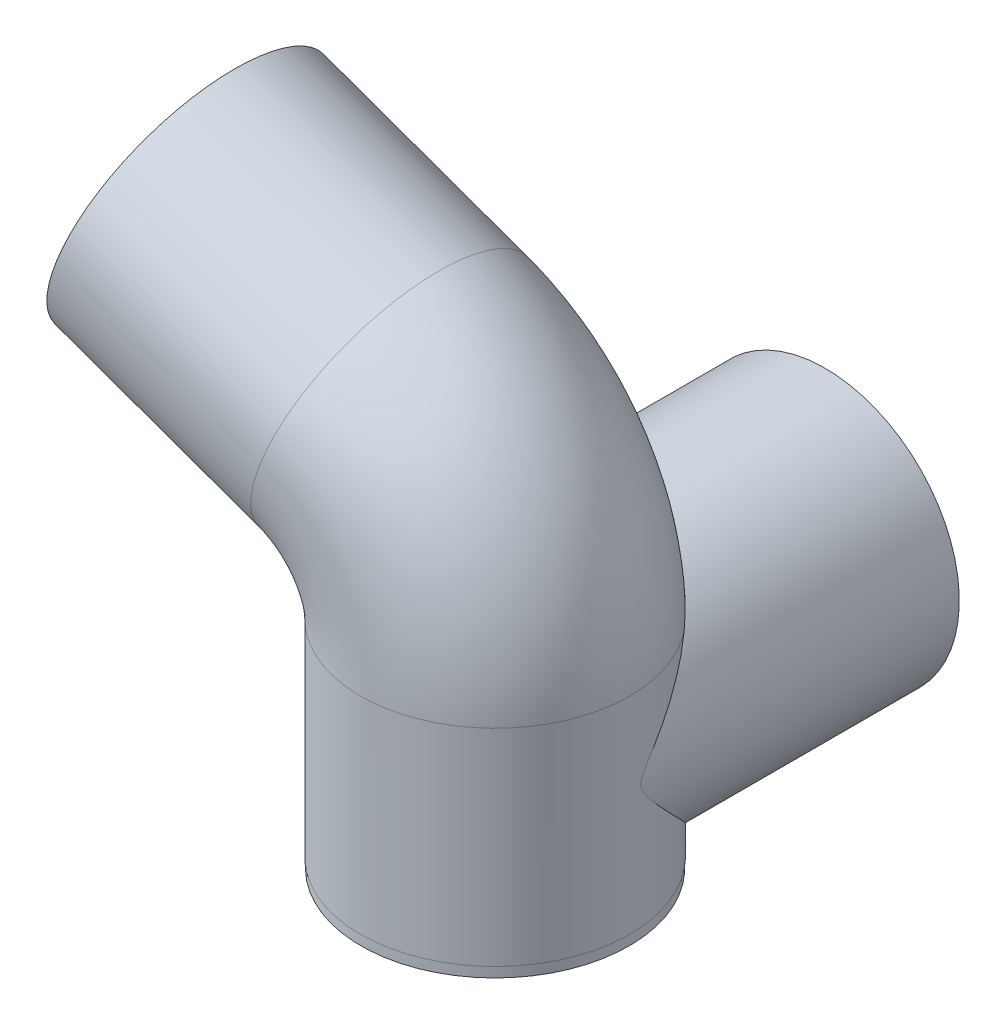
ISO-10303-21;
HEADER;
FILE_DESCRIPTION(('STEP AP214'),'2;1');
FILE_NAME('part.step','',(''),(''),'','','');
FILE_SCHEMA(('AUTOMOTIVE_DESIGN { 1 0 10303 214 1 1 1 1 }'));
ENDSEC;
DATA;
#1=APPLICATION_CONTEXT('core data for automotive mechanical design processes');
#2=APPLICATION_PROTOCOL_DEFINITION('international standard','automotive_design',2000,#1);
#3=PRODUCT_CONTEXT('',#1,'mechanical');
#4=PRODUCT('Part','Part','',(#3));
#5=PRODUCT_RELATED_PRODUCT_CATEGORY('part','',(#4));
#6=PRODUCT_DEFINITION_FORMATION('','',#4);
#7=PRODUCT_DEFINITION_CONTEXT('part definition',#1,'design');
#8=PRODUCT_DEFINITION('design','',#6,#7);
#9=PRODUCT_DEFINITION_SHAPE('','',#8);
#10=(LENGTH_UNIT() NAMED_UNIT(*) SI_UNIT(.MILLI.,.METRE.));
#11=(NAMED_UNIT(*) PLANE_ANGLE_UNIT() SI_UNIT($,.RADIAN.));
#12=(NAMED_UNIT(*) SI_UNIT($,.STERADIAN.) SOLID_ANGLE_UNIT());
#13=UNCERTAINTY_MEASURE_WITH_UNIT(LENGTH_MEASURE(1.E-05),#10,'distance_accuracy_value','');
#14=(GEOMETRIC_REPRESENTATION_CONTEXT(3) GLOBAL_UNCERTAINTY_ASSIGNED_CONTEXT((#13)) GLOBAL_UNIT_ASSIGNED_CONTEXT((#10,
#11,#12)) REPRESENTATION_CONTEXT('',''));
#15=CARTESIAN_POINT('',(0.,0.,0.));
#16=DIRECTION('',(0.,0.,1.));
#17=DIRECTION('',(1.,0.,0.));
#18=AXIS2_PLACEMENT_3D('',#15,#16,#17);
#19=CARTESIAN_POINT('',(0.,0.,0.));
#20=DIRECTION('',(0.,1.,0.));
#21=DIRECTION('',(0.,0.,1.));
#22=AXIS2_PLACEMENT_3D('',#19,#20,#21);
#23=PLANE('',#22);
#24=CARTESIAN_POINT('',(0.,0.,0.));
#25=DIRECTION('',(0.,1.,0.));
#26=DIRECTION('',(0.,0.,1.));
#27=AXIS2_PLACEMENT_3D('',#24,#25,#26);
#28=CIRCLE('',#27,13.);
#29=CARTESIAN_POINT('',(0.,0.,-13.));
#30=VERTEX_POINT('',#29);
#31=EDGE_CURVE('E59',#30,#30,#28,.T.);
#32=ORIENTED_EDGE('',*,*,#31,.F.);
#33=EDGE_LOOP('',(#32));
#34=FACE_BOUND('',#33,.T.);
#35=CARTESIAN_POINT('',(0.,0.,0.));
#36=DIRECTION('',(0.,1.,0.));
#37=DIRECTION('',(0.,0.,1.));
#38=AXIS2_PLACEMENT_3D('',#35,#36,#37);
#39=CIRCLE('',#38,11.05);
#40=CARTESIAN_POINT('',(0.,0.,11.05));
#41=VERTEX_POINT('',#40);
#42=EDGE_CURVE('E156',#41,#41,#39,.T.);
#43=ORIENTED_EDGE('',*,*,#42,.T.);
#44=EDGE_LOOP('',(#43));
#45=FACE_BOUND('',#44,.T.);
#46=ADVANCED_FACE('F55',(#34,#45),#23,.F.);
#47=CARTESIAN_POINT('',(0.,1.,0.));
#48=DIRECTION('',(0.,-1.,0.));
#49=DIRECTION('',(0.,0.,-1.));
#50=AXIS2_PLACEMENT_3D('',#47,#48,#49);
#51=CYLINDRICAL_SURFACE('',#50,13.);
#52=CARTESIAN_POINT('',(0.,1.,0.));
#53=DIRECTION('',(0.,1.,0.));
#54=DIRECTION('',(0.,0.,1.));
#55=AXIS2_PLACEMENT_3D('',#52,#53,#54);
#56=CIRCLE('',#55,13.);
#57=CARTESIAN_POINT('',(-5.00000000000006,1.,-12.));
#58=VERTEX_POINT('',#57);
#59=CARTESIAN_POINT('',(5.,1.,-12.));
#60=VERTEX_POINT('',#59);
#61=EDGE_CURVE('E12',#58,#60,#56,.T.);
#62=ORIENTED_EDGE('',*,*,#61,.F.);
#63=CARTESIAN_POINT('',(0.,13.,0.));
#64=DIRECTION('',(0.,0.707106781186548,-0.707106781186547));
#65=DIRECTION('',(0.,-0.707106781186548,-0.707106781186547));
#66=AXIS2_PLACEMENT_3D('',#63,#64,#65);
#67=ELLIPSE('',#66,18.3847763108502,13.);
#68=EDGE_CURVE('E131',#30,#58,#67,.T.);
#69=ORIENTED_EDGE('',*,*,#68,.F.);
#70=ORIENTED_EDGE('',*,*,#31,.T.);
#71=EDGE_CURVE('E124',#60,#30,#67,.T.);
#72=ORIENTED_EDGE('',*,*,#71,.F.);
#73=EDGE_LOOP('',(#62,#69,#70,#72));
#74=FACE_BOUND('',#73,.T.);
#75=ADVANCED_FACE('F57',(#74),#51,.T.);
#76=CARTESIAN_POINT('',(0.,1.,0.));
#77=DIRECTION('',(0.,-1.,0.));
#78=DIRECTION('',(0.,0.,-1.));
#79=AXIS2_PLACEMENT_3D('',#76,#77,#78);
#80=CYLINDRICAL_SURFACE('',#79,11.05);
#81=CARTESIAN_POINT('',(0.,13.,0.));
#82=DIRECTION('',(0.,-0.707106781186547,-0.707106781186547));
#83=DIRECTION('',(0.,0.707106781186547,-0.707106781186547));
#84=AXIS2_PLACEMENT_3D('',#81,#82,#83);
#85=ELLIPSE('',#84,15.6270598642227,11.05);
#86=CARTESIAN_POINT('',(7.62249959002947,21.,-8.00000000000004));
#87=VERTEX_POINT('',#86);
#88=CARTESIAN_POINT('',(11.0500000000001,13.,0.));
#89=VERTEX_POINT('',#88);
#90=EDGE_CURVE('E71',#87,#89,#85,.T.);
#91=ORIENTED_EDGE('',*,*,#90,.T.);
#92=CARTESIAN_POINT('',(0.,13.,0.));
#93=DIRECTION('',(0.,0.707106781186547,-0.707106781186547));
#94=DIRECTION('',(0.,-0.707106781186547,-0.707106781186547));
#95=AXIS2_PLACEMENT_3D('',#92,#93,#94);
#96=ELLIPSE('',#95,15.6270598642227,11.05);
#97=CARTESIAN_POINT('',(-11.05,13.,0.));
#98=VERTEX_POINT('',#97);
#99=EDGE_CURVE('E117',#89,#98,#96,.T.);
#100=ORIENTED_EDGE('',*,*,#99,.T.);
#101=CARTESIAN_POINT('',(-7.62249959002946,21.,-8.00000000000005));
#102=VERTEX_POINT('',#101);
#103=EDGE_CURVE('E106',#98,#102,#85,.T.);
#104=ORIENTED_EDGE('',*,*,#103,.T.);
#105=CARTESIAN_POINT('',(0.,21.,0.));
#106=DIRECTION('',(0.,-1.,0.));
#107=DIRECTION('',(1.,0.,0.));
#108=AXIS2_PLACEMENT_3D('',#105,#106,#107);
#109=CIRCLE('',#108,11.05);
#110=EDGE_CURVE('E116',#87,#102,#109,.T.);
#111=ORIENTED_EDGE('',*,*,#110,.F.);
#112=EDGE_LOOP('',(#91,#100,#104,#111));
#113=FACE_BOUND('',#112,.T.);
#114=ORIENTED_EDGE('',*,*,#42,.F.);
#115=EDGE_LOOP('',(#114));
#116=FACE_BOUND('',#115,.T.);
#117=ADVANCED_FACE('F114',(#113,#116),#80,.F.);
#118=CARTESIAN_POINT('',(0.,1.,0.));
#119=DIRECTION('',(0.,-1.,0.));
#120=DIRECTION('',(1.,0.,0.));
#121=AXIS2_PLACEMENT_3D('',#118,#119,#120);
#122=PLANE('',#121);
#123=DIRECTION('',(0.,0.,-1.));
#124=VECTOR('',#123,1.);
#125=CARTESIAN_POINT('',(-4.9999999999998,0.999999999999997,13.052));
#126=LINE('',#125,#124);
#127=CARTESIAN_POINT('',(-4.99999999999998,1.,-12.0541486634271));
#128=VERTEX_POINT('',#127);
#129=EDGE_CURVE('E134',#128,#58,#126,.F.);
#130=ORIENTED_EDGE('',*,*,#129,.T.);
#131=ORIENTED_EDGE('',*,*,#61,.T.);
#132=DIRECTION('',(0.,0.,-1.));
#133=VECTOR('',#132,1.);
#134=CARTESIAN_POINT('',(5.00000000000018,0.999999999999991,13.052));
#135=LINE('',#134,#133);
#136=CARTESIAN_POINT('',(5.00000000000001,0.999999999999994,-12.054148663427));
#137=VERTEX_POINT('',#136);
#138=EDGE_CURVE('E259',#60,#137,#135,.T.);
#139=ORIENTED_EDGE('',*,*,#138,.T.);
#140=CARTESIAN_POINT('',(0.,1.,0.));
#141=DIRECTION('',(0.,-1.,0.));
#142=DIRECTION('',(1.,0.,0.));
#143=AXIS2_PLACEMENT_3D('',#140,#141,#142);
#144=CIRCLE('',#143,13.05);
#145=EDGE_CURVE('E140',#137,#128,#144,.T.);
#146=ORIENTED_EDGE('',*,*,#145,.T.);
#147=EDGE_LOOP('',(#130,#131,#139,#146));
#148=FACE_BOUND('',#147,.T.);
#149=ADVANCED_FACE('F176',(#148),#122,.T.);
#150=CARTESIAN_POINT('',(-29.6774273443593,42.2267078594645,0.));
#151=DIRECTION('',(0.940880768954225,-0.338737920245293,0.));
#152=DIRECTION('',(0.338737920245293,0.940880768954225,0.));
#153=AXIS2_PLACEMENT_3D('',#150,#151,#152);
#154=PLANE('',#153);
#155=CARTESIAN_POINT('',(-29.6774273443593,42.2267078594645,0.));
#156=DIRECTION('',(0.940880768954225,-0.338737920245293,0.));
#157=DIRECTION('',(0.338737920245293,0.940880768954225,0.));
#158=AXIS2_PLACEMENT_3D('',#155,#156,#157);
#159=CIRCLE('',#158,11.05);
#160=CARTESIAN_POINT('',(-25.9343733256489,52.6234403564087,0.));
#161=VERTEX_POINT('',#160);
#162=EDGE_CURVE('E129',#161,#161,#159,.T.);
#163=ORIENTED_EDGE('',*,*,#162,.T.);
#164=EDGE_LOOP('',(#163));
#165=FACE_BOUND('',#164,.T.);
#166=CARTESIAN_POINT('',(-29.6774273443593,42.2267078594645,0.));
#167=DIRECTION('',(0.940880768954225,-0.338737920245293,0.));
#168=DIRECTION('',(0.338737920245293,0.940880768954225,0.));
#169=AXIS2_PLACEMENT_3D('',#166,#167,#168);
#170=CIRCLE('',#169,13.05);
#171=CARTESIAN_POINT('',(-25.2568974851583,54.5052018943171,0.));
#172=VERTEX_POINT('',#171);
#173=EDGE_CURVE('E149',#172,#172,#170,.T.);
#174=ORIENTED_EDGE('',*,*,#173,.F.);
#175=EDGE_LOOP('',(#174));
#176=FACE_BOUND('',#175,.T.);
#177=ADVANCED_FACE('F188',(#165,#176),#154,.F.);
#178=CARTESIAN_POINT('',(0.,1.,0.));
#179=DIRECTION('',(0.,1.,0.));
#180=DIRECTION('',(0.,0.,1.));
#181=AXIS2_PLACEMENT_3D('',#178,#179,#180);
#182=CYLINDRICAL_SURFACE('',#181,13.05);
#183=ORIENTED_EDGE('',*,*,#145,.F.);
#184=CARTESIAN_POINT('',(10.2469507659596,21.,-8.08099622571369));
#185=CARTESIAN_POINT('',(10.3808410462382,20.8284917543246,-7.91121067679215));
#186=CARTESIAN_POINT('',(10.5094661617356,20.6548757455195,-7.73944037509073));
#187=CARTESIAN_POINT('',(10.7563809429985,20.3038590573796,-7.39243812402004));
#188=CARTESIAN_POINT('',(10.8746722408285,20.1264589812052,-7.21720672665592));
#189=CARTESIAN_POINT('',(11.1011133739727,19.7683186934407,-6.86380341560327));
#190=CARTESIAN_POINT('',(11.2092670542295,19.5875797795771,-6.6856326471428));
#191=CARTESIAN_POINT('',(11.4156826720345,19.2230271492222,-6.32673262151035));
#192=CARTESIAN_POINT('',(11.5139442164868,19.0392133108771,-6.14600326298981));
#193=CARTESIAN_POINT('',(11.7933954977298,18.485120511006,-5.60214581959144));
#194=CARTESIAN_POINT('',(11.9602212374878,18.1106463285789,-5.23582227934634));
#195=CARTESIAN_POINT('',(12.2566354160424,17.352115092751,-4.49833684960306));
#196=CARTESIAN_POINT('',(12.3862324168029,16.9680602648504,-4.1271760931404));
#197=CARTESIAN_POINT('',(12.5623553430608,16.3529451040081,-3.54122118979744));
#198=CARTESIAN_POINT('',(12.6209045680761,16.1254114317597,-3.32625979739433));
#199=CARTESIAN_POINT('',(12.7259619832473,15.6656468472234,-2.89839730757131));
#200=CARTESIAN_POINT('',(12.7724714758277,15.4334164459471,-2.68549598969885));
#201=CARTESIAN_POINT('',(12.8391301604418,15.0446571069226,-2.34058353361841));
#202=CARTESIAN_POINT('',(12.8627816636026,14.8904435329805,-2.20662626494794));
#203=CARTESIAN_POINT('',(12.9050331601704,14.5765031408036,-1.94424342329985));
#204=CARTESIAN_POINT('',(12.9236326490663,14.4167757737369,-1.81581840386773));
#205=CARTESIAN_POINT('',(12.9491792950359,14.1526653618386,-1.62073610916529));
#206=CARTESIAN_POINT('',(12.9578162870282,14.051592184922,-1.54985829636127));
#207=CARTESIAN_POINT('',(12.9730320212486,13.8434291876135,-1.41680751451272));
#208=CARTESIAN_POINT('',(12.9796110245195,13.736340132332,-1.35463344200736));
#209=CARTESIAN_POINT('',(12.9883696046164,13.5542758365987,-1.26726080635209));
#210=CARTESIAN_POINT('',(12.9912779029396,13.4819111290161,-1.23686130269502));
#211=CARTESIAN_POINT('',(12.9959299885436,13.3335802475062,-1.18698398858763));
#212=CARTESIAN_POINT('',(12.9976782423569,13.2576291075595,-1.16746433436077));
#213=CARTESIAN_POINT('',(12.9998357442867,13.101907499195,-1.14322119940031));
#214=CARTESIAN_POINT('',(13.000222583798,13.022094841885,-1.13874539046551));
#215=CARTESIAN_POINT('',(12.9995249758655,12.8633325907508,-1.14667072324129));
#216=CARTESIAN_POINT('',(12.9984392905787,12.7843837793599,-1.15908606412156));
#217=CARTESIAN_POINT('',(12.9945253148589,12.6104745231601,-1.2022264894999));
#218=CARTESIAN_POINT('',(12.9913242484745,12.5165445995239,-1.23680325917943));
#219=CARTESIAN_POINT('',(12.9832656874965,12.3342476517767,-1.31871580503453));
#220=CARTESIAN_POINT('',(12.9783981155876,12.2459184393391,-1.36612882791994));
#221=CARTESIAN_POINT('',(12.9671054278656,12.0715685929964,-1.46951009975087));
#222=CARTESIAN_POINT('',(12.96064374859,11.9856643223701,-1.52566572928785));
#223=CARTESIAN_POINT('',(12.9463490073172,11.8171269200464,-1.64257138028421));
#224=CARTESIAN_POINT('',(12.9385148978194,11.734496346478,-1.70332489078995));
#225=CARTESIAN_POINT('',(12.9130112432641,11.489631672811,-1.89006765275296));
#226=CARTESIAN_POINT('',(12.8933687886485,11.3308411721565,-2.02026533621046));
#227=CARTESIAN_POINT('',(12.8489230154375,11.0175274002601,-2.28605725641017));
#228=CARTESIAN_POINT('',(12.8240978178178,10.8630254711406,-2.42167233422897));
#229=CARTESIAN_POINT('',(12.7694080525553,10.5574049696717,-2.69520731115324));
#230=CARTESIAN_POINT('',(12.7395510318893,10.406281708735,-2.83312348389441));
#231=CARTESIAN_POINT('',(12.6559032832171,10.0188718397944,-3.19080756683837));
#232=CARTESIAN_POINT('',(12.5982994718524,9.78423476792043,-3.41147553451599));
#233=CARTESIAN_POINT('',(12.4702690353903,9.31889108673759,-3.85329376828967));
#234=CARTESIAN_POINT('',(12.3998403751194,9.08818510761678,-4.07444410542174));
#235=CARTESIAN_POINT('',(12.2458822911106,8.63000625267417,-4.51615275042353));
#236=CARTESIAN_POINT('',(12.1623367176265,8.40253774448792,-4.73670998298098));
#237=CARTESIAN_POINT('',(11.9819937981104,7.95115187512437,-5.17597401026042));
#238=CARTESIAN_POINT('',(11.8851971905002,7.72723431684361,-5.39468090737286));
#239=CARTESIAN_POINT('',(11.5749956116551,7.06210312414209,-6.04589605550298));
#240=CARTESIAN_POINT('',(11.3413966441153,6.62636466762003,-6.47461058870069));
#241=CARTESIAN_POINT('',(10.8180596589172,5.7736906031614,-7.31554881329494));
#242=CARTESIAN_POINT('',(10.5283711072808,5.35673882354873,-7.72778665200868));
#243=CARTESIAN_POINT('',(10.0080048463175,4.69667009467079,-8.38131969639317));
#244=CARTESIAN_POINT('',(9.79511015214829,4.44627912672783,-8.6294639878954));
#245=CARTESIAN_POINT('',(9.34521897009939,3.95690863050472,-9.11476890940701));
#246=CARTESIAN_POINT('',(9.10822216250644,3.71792925366054,-9.35192939365603));
#247=CARTESIAN_POINT('',(8.36161901468556,3.02282819346423,-10.0420811889809));
#248=CARTESIAN_POINT('',(7.81458720312425,2.58619023107309,-10.4760751758488));
#249=CARTESIAN_POINT('',(6.88014261209599,1.96241614889428,-11.0964056281183));
#250=CARTESIAN_POINT('',(6.52672500782917,1.74933549740671,-11.308384532796));
#251=CARTESIAN_POINT('',(5.78737907084385,1.35169416009695,-11.7040652013761));
#252=CARTESIAN_POINT('',(5.40133501385108,1.16724218997281,-11.8876591654066));
#253=CARTESIAN_POINT('',(5.00000000000001,0.999999999999995,-12.054148663427));
#254=B_SPLINE_CURVE_WITH_KNOTS('',3,(#184,#185,#186,#187,#188,#189,#190,#191,#192,#193,#194,
#195,#196,#197,#198,#199,#200,#201,#202,#203,#204,#205,#206,#207,#208,#209,#210,#211,#212,#213,
#214,#215,#216,#217,#218,#219,#220,#221,#222,#223,#224,#225,#226,#227,#228,#229,#230,#231,#232,
#233,#234,#235,#236,#237,#238,#239,#240,#241,#242,#243,#244,#245,#246,#247,#248,#249,#250,#251,
#252,#253),.UNSPECIFIED.,.F.,.F.,(4,2,2,2,2,2,2,2,2,2,2,2,2,2,2,2,2,2,2,2,2,2,2,2,2,2,2,2,2,2,2,
2,2,2,4),(0.,0.827860569507917,1.65559015415475,2.48300452069316,3.31045175424137,
4.95823234610708,6.6056336730822,7.56076650035601,8.51579596080153,9.13262127185925,
9.74950815851308,10.1205697783006,10.491584312182,10.7266555971372,10.960816449791,
11.198813968689,11.437011678578,11.7357512730699,12.0363302136753,12.344576495827,
12.6530590786755,13.2715174208565,13.8926413904238,14.5128419258983,15.4941735699053,
16.4756610772151,17.4583666230209,18.4410174292603,20.4014092010265,22.3600798924043,
23.5945638255137,24.8290641361233,27.2868322024077,28.6761135993902,30.0705480193618),.UNSPECIFIED.);
#255=CARTESIAN_POINT('',(10.2469507659596,21.,-8.08099622571369));
#256=VERTEX_POINT('',#255);
#257=EDGE_CURVE('E215',#256,#137,#254,.T.);
#258=ORIENTED_EDGE('',*,*,#257,.F.);
#259=CARTESIAN_POINT('',(0.,21.,0.));
#260=DIRECTION('',(0.,1.,0.));
#261=DIRECTION('',(0.,0.,1.));
#262=AXIS2_PLACEMENT_3D('',#259,#260,#261);
#263=CIRCLE('',#262,13.05);
#264=CARTESIAN_POINT('',(-10.2469507659596,21.,-8.08099622571381));
#265=VERTEX_POINT('',#264);
#266=EDGE_CURVE('E141',#256,#265,#263,.F.);
#267=ORIENTED_EDGE('',*,*,#266,.T.);
#268=CARTESIAN_POINT('',(-4.99999999999997,0.999999999999994,-12.0541486634271));
#269=CARTESIAN_POINT('',(-5.34638084901516,1.14430929580326,-11.9104888675632));
#270=CARTESIAN_POINT('',(-5.68158020263314,1.30158545174516,-11.7539412628717));
#271=CARTESIAN_POINT('',(-6.32808172703819,1.63831867931531,-11.418844964153));
#272=CARTESIAN_POINT('',(-6.63943088443202,1.81773022069798,-11.2403414334841));
#273=CARTESIAN_POINT('',(-7.2349458013601,2.19359807148146,-10.8664829292647));
#274=CARTESIAN_POINT('',(-7.51936389287263,2.38985438639813,-10.6713258074812));
#275=CARTESIAN_POINT('',(-8.06483397140468,2.79830338451222,-10.2653113859296));
#276=CARTESIAN_POINT('',(-8.32587086662748,3.01050620047387,-10.0544441043165));
#277=CARTESIAN_POINT('',(-8.89541289957785,3.5103704883018,-9.55795479140458));
#278=CARTESIAN_POINT('',(-9.19640687817071,3.80237449798623,-9.26808244600024));
#279=CARTESIAN_POINT('',(-9.76122274753667,4.40413570848108,-8.67121182670132));
#280=CARTESIAN_POINT('',(-10.0250387073017,4.71389573084447,-8.36421083115384));
#281=CARTESIAN_POINT('',(-10.5182432249781,5.34955594431116,-7.73496841047871));
#282=CARTESIAN_POINT('',(-10.7474285533846,5.67553753803669,-7.41265058498291));
#283=CARTESIAN_POINT('',(-11.1709227894735,6.33926048237267,-6.75759551059417));
#284=CARTESIAN_POINT('',(-11.3652350833631,6.6770006874033,-6.4248592770282));
#285=CARTESIAN_POINT('',(-11.7250006949731,7.37138359299047,-5.74276618100202));
#286=CARTESIAN_POINT('',(-11.8895531976566,7.72829002125159,-5.3932025254745));
#287=CARTESIAN_POINT('',(-12.1107102854928,8.27043623998956,-4.8651457829194));
#288=CARTESIAN_POINT('',(-12.1801624779816,8.45232128163261,-4.68847119008838));
#289=CARTESIAN_POINT('',(-12.310625779814,8.81834366182718,-4.33434935193871));
#290=CARTESIAN_POINT('',(-12.3716374840154,9.00248084065894,-4.15690216198025));
#291=CARTESIAN_POINT('',(-12.4850501188723,9.37222688460623,-3.8026884191067));
#292=CARTESIAN_POINT('',(-12.537491478914,9.55782423908882,-3.62592275240657));
#293=CARTESIAN_POINT('',(-12.6342191446449,9.93180063342107,-3.27298906515453));
#294=CARTESIAN_POINT('',(-12.6785033158639,10.1201803874444,-3.0968212128345));
#295=CARTESIAN_POINT('',(-12.7589587321999,10.5006445315709,-2.74659598640575));
#296=CARTESIAN_POINT('',(-12.7951285711369,10.6927295575285,-2.5725389830345));
#297=CARTESIAN_POINT('',(-12.859338406613,11.0825427807694,-2.22936943421657));
#298=CARTESIAN_POINT('',(-12.8873834291233,11.2802674059054,-2.06025389048042));
#299=CARTESIAN_POINT('',(-12.9245874627175,11.597149754442,-1.80721164498739));
#300=CARTESIAN_POINT('',(-12.9366096099952,11.7123164995461,-1.71873026252299));
#301=CARTESIAN_POINT('',(-12.9579386263644,11.9483734945605,-1.54965960224974));
#302=CARTESIAN_POINT('',(-12.96725230427,12.0692484885474,-1.46905087858972));
#303=CARTESIAN_POINT('',(-12.9798628460705,12.2725628206621,-1.35193205019642));
#304=CARTESIAN_POINT('',(-12.9840973396402,12.3519631931181,-1.31036598102015));
#305=CARTESIAN_POINT('',(-12.9912252667023,12.5155105876625,-1.23769515211678));
#306=CARTESIAN_POINT('',(-12.9941221599044,12.5996447255397,-1.20656346170915));
#307=CARTESIAN_POINT('',(-12.9977901826667,12.7515549282072,-1.1663066924485));
#308=CARTESIAN_POINT('',(-12.9989063763,12.8183528622688,-1.15367649760553));
#309=CARTESIAN_POINT('',(-13.0000888743072,12.9530732006234,-1.1402820724684));
#310=CARTESIAN_POINT('',(-13.0001574194095,13.0209928938876,-1.13949251728264));
#311=CARTESIAN_POINT('',(-12.9992421146122,13.1557097909323,-1.14987942821688));
#312=CARTESIAN_POINT('',(-12.9982603011211,13.2225089126526,-1.16103273984918));
#313=CARTESIAN_POINT('',(-12.9953531541089,13.3537372540458,-1.19312517689357));
#314=CARTESIAN_POINT('',(-12.9934254636304,13.4181601190981,-1.21408874164297));
#315=CARTESIAN_POINT('',(-12.9879736453713,13.5653839848603,-1.27126038459479));
#316=CARTESIAN_POINT('',(-12.9841305248472,13.6470687648285,-1.31022474875113));
#317=CARTESIAN_POINT('',(-12.9752143612834,13.8063455381836,-1.39577102827164));
#318=CARTESIAN_POINT('',(-12.970138342631,13.8839270681895,-1.44237128304121));
#319=CARTESIAN_POINT('',(-12.9588311726195,14.0366302029562,-1.54067080735588));
#320=CARTESIAN_POINT('',(-12.9525902256868,14.1117240680944,-1.59241143381055));
#321=CARTESIAN_POINT('',(-12.9390554902875,14.2594954819866,-1.69889257615783));
#322=CARTESIAN_POINT('',(-12.9317629068679,14.3321756807989,-1.7536296145851));
#323=CARTESIAN_POINT('',(-12.906333747889,14.5662950447852,-1.93522813423835));
#324=CARTESIAN_POINT('',(-12.8861000576743,14.7243261874838,-2.0661654175252));
#325=CARTESIAN_POINT('',(-12.8405649813117,15.0358208653184,-2.33255099980651));
#326=CARTESIAN_POINT('',(-12.8152609093555,15.1892819299643,-2.46800165772229));
#327=CARTESIAN_POINT('',(-12.7595673229162,15.4934695003534,-2.74142834067546));
#328=CARTESIAN_POINT('',(-12.729169485663,15.6441910758361,-2.87940816408686));
#329=CARTESIAN_POINT('',(-12.6633178233843,15.9434370707905,-3.1564503733346));
#330=CARTESIAN_POINT('',(-12.6278651634818,16.0919619879027,-3.29551250273828));
#331=CARTESIAN_POINT('',(-12.5142222286637,16.533621223133,-3.71204186153308));
#332=CARTESIAN_POINT('',(-12.4284866874759,16.8242525899349,-3.99014649026773));
#333=CARTESIAN_POINT('',(-12.2365749242806,17.3997814501786,-4.54476625427386));
#334=CARTESIAN_POINT('',(-12.1304137386765,17.6846829922855,-4.82128240564205));
#335=CARTESIAN_POINT('',(-11.904772260236,18.230468662362,-5.35320605215669));
#336=CARTESIAN_POINT('',(-11.7866157195529,18.4917056339759,-5.60881211617946));
#337=CARTESIAN_POINT('',(-11.5315467719959,19.0088725260255,-6.11608865183759));
#338=CARTESIAN_POINT('',(-11.3946322491094,19.2648018439705,-6.36775867589045));
#339=CARTESIAN_POINT('',(-11.1010211089286,19.7715159431922,-6.8668769949123));
#340=CARTESIAN_POINT('',(-10.9442545255418,20.0222786919062,-7.11430666126481));
#341=CARTESIAN_POINT('',(-10.6107336950738,20.5167199925276,-7.60277466521272));
#342=CARTESIAN_POINT('',(-10.4339760523403,20.7603973320545,-7.84381190839087));
#343=CARTESIAN_POINT('',(-10.2469507659596,21.,-8.08099622571381));
#344=B_SPLINE_CURVE_WITH_KNOTS('',3,(#268,#269,#270,#271,#272,#273,#274,#275,#276,#277,#278,
#279,#280,#281,#282,#283,#284,#285,#286,#287,#288,#289,#290,#291,#292,#293,#294,#295,#296,#297,
#298,#299,#300,#301,#302,#303,#304,#305,#306,#307,#308,#309,#310,#311,#312,#313,#314,#315,#316,
#317,#318,#319,#320,#321,#322,#323,#324,#325,#326,#327,#328,#329,#330,#331,#332,#333,#334,#335,
#336,#337,#338,#339,#340,#341,#342,#343),.UNSPECIFIED.,.F.,.F.,(4,2,2,2,2,2,2,2,2,2,2,2,2,2,2,2,
2,2,2,2,2,2,2,2,2,2,2,2,2,2,2,2,2,2,2,2,2,4),(0.,1.20428926669781,2.40614148584412,
3.5953024393574,4.78522550782641,6.31235305267954,7.83972394501634,9.37573644606466,
10.9115997179419,12.4881475338789,13.2767495759185,14.0652960115386,14.8500079380052,
15.6349249071872,16.4199777943194,17.2045440095778,17.6416054137102,18.0775583993698,
18.3463099028656,18.6143623307783,18.8174411087055,19.02008547739,19.222337675138,
19.4250964286079,19.6961298856051,19.9678241007749,20.2419152144529,20.5156947127011,
21.1340218303394,21.7526773491455,22.3723537337005,22.9918875147332,24.2251614790565,
25.4575310146462,26.6093663726344,27.761331771694,28.917476426147,30.0738177574276),.UNSPECIFIED.);
#345=EDGE_CURVE('E79',#128,#265,#344,.T.);
#346=ORIENTED_EDGE('',*,*,#345,.F.);
#347=EDGE_LOOP('',(#183,#258,#267,#346));
#348=FACE_BOUND('',#347,.T.);
#349=ADVANCED_FACE('F184',(#348),#182,.T.);
#350=CARTESIAN_POINT('',(-15.,21.,0.));
#351=DIRECTION('',(0.,0.,1.));
#352=DIRECTION('',(1.,0.,0.));
#353=AXIS2_PLACEMENT_3D('',#350,#351,#352);
#354=TOROIDAL_SURFACE('',#353,15.,13.05);
#355=CARTESIAN_POINT('',(-9.91893119632059,35.1132115343134,0.));
#356=DIRECTION('',(0.940880768954225,-0.338737920245294,0.));
#357=DIRECTION('',(0.338737920245294,0.940880768954225,0.));
#358=AXIS2_PLACEMENT_3D('',#355,#356,#357);
#359=CIRCLE('',#358,13.05);
#360=CARTESIAN_POINT('',(-5.4984013371195,47.391705569166,0.));
#361=VERTEX_POINT('',#360);
#362=EDGE_CURVE('E145',#361,#361,#359,.T.);
#363=ORIENTED_EDGE('',*,*,#362,.T.);
#364=EDGE_LOOP('',(#363));
#365=FACE_BOUND('',#364,.T.);
#366=ORIENTED_EDGE('',*,*,#266,.F.);
#367=CARTESIAN_POINT('',(-10.2471069068298,20.9998,-8.08079823570913));
#368=CARTESIAN_POINT('',(-10.1873515539215,21.0763273177565,-8.15662018213949));
#369=CARTESIAN_POINT('',(-10.1272321548019,21.1515818838822,-8.23341570070071));
#370=CARTESIAN_POINT('',(-10.0059853388723,21.2999698162124,-8.38823541736748));
#371=CARTESIAN_POINT('',(-9.94485801618966,21.3731033787516,-8.46625950071033));
#372=CARTESIAN_POINT('',(-9.82128005337679,21.5177161928836,-8.62286312704775));
#373=CARTESIAN_POINT('',(-9.75882890047729,21.5891947801551,-8.70144287711879));
#374=CARTESIAN_POINT('',(-9.63239213467286,21.7307517202444,-8.85863136557227));
#375=CARTESIAN_POINT('',(-9.56840648481924,21.800830039271,-8.93724010460776));
#376=CARTESIAN_POINT('',(-9.37290426684662,22.0102926107974,-9.1735904316221));
#377=CARTESIAN_POINT('',(-9.23871460430078,22.1478830755075,-9.33073016316321));
#378=CARTESIAN_POINT('',(-8.96190131589756,22.4192270965166,-9.64080278372335));
#379=CARTESIAN_POINT('',(-8.81927903681041,22.5529812604696,-9.79373633882363));
#380=CARTESIAN_POINT('',(-8.52285016727913,22.8184038145369,-10.0952438441522));
#381=CARTESIAN_POINT('',(-8.36893329098103,22.950030183365,-10.2437469058704));
#382=CARTESIAN_POINT('',(-8.05061815170026,23.2092934767777,-10.5328869398693));
#383=CARTESIAN_POINT('',(-7.88621869966372,23.3369299463263,-10.6735230163777));
#384=CARTESIAN_POINT('',(-7.54699433836962,23.587121664612,-10.9450806107868));
#385=CARTESIAN_POINT('',(-7.3722029856657,23.7096913100937,-11.0760306276381));
#386=CARTESIAN_POINT('',(-7.01160231058391,23.9491670442928,-11.3274237496738));
#387=CARTESIAN_POINT('',(-6.82579604820082,24.0660746896951,-11.4478697501609));
#388=CARTESIAN_POINT('',(-6.42600075488478,24.3033302698505,-11.6875394301171));
#389=CARTESIAN_POINT('',(-6.21097985029615,24.4230424052421,-11.8056794744231));
#390=CARTESIAN_POINT('',(-5.7683580128013,24.652820836707,-12.0271083698737));
#391=CARTESIAN_POINT('',(-5.54075286335317,24.7628838673698,-12.1303922009578));
#392=CARTESIAN_POINT('',(-5.07520977709801,24.9710862850688,-12.3206273652652));
#393=CARTESIAN_POINT('',(-4.83733333731706,25.0692860623391,-12.4076627654928));
#394=CARTESIAN_POINT('',(-4.3514525411828,25.2528481797485,-12.5654201833156));
#395=CARTESIAN_POINT('',(-4.10344938375512,25.3382120339912,-12.6361441255088));
#396=CARTESIAN_POINT('',(-3.59767886964876,25.4950846698832,-12.761226070238));
#397=CARTESIAN_POINT('',(-3.33987019025713,25.5665246451045,-12.8155034973434));
#398=CARTESIAN_POINT('',(-2.81748074479997,25.6938599414879,-12.907144666016));
#399=CARTESIAN_POINT('',(-2.5528996524975,25.7497545122606,-12.9445075911609));
#400=CARTESIAN_POINT('',(-2.01853503789048,25.8452056379691,-13.0025459539381));
#401=CARTESIAN_POINT('',(-1.74874340503454,25.8847341373805,-13.0231927934329));
#402=CARTESIAN_POINT('',(-1.20647391482452,25.9467716373982,-13.0481075212264));
#403=CARTESIAN_POINT('',(-0.933996119728901,25.9692810315291,-13.0523757882484));
#404=CARTESIAN_POINT('',(-0.397948217774639,25.996581457624,-13.0452671666851));
#405=CARTESIAN_POINT('',(-0.134400317667092,26.0019653606646,-13.0344329174157));
#406=CARTESIAN_POINT('',(0.391567077390866,25.9967627862585,-12.9987451509668));
#407=CARTESIAN_POINT('',(0.653986603697292,25.9861767555092,-12.9738920259236));
#408=CARTESIAN_POINT('',(1.17600985271705,25.949341611684,-12.9109213894321));
#409=CARTESIAN_POINT('',(1.43561454651542,25.9230980874344,-12.8728086129408));
#410=CARTESIAN_POINT('',(1.95068990281091,25.8554383756665,-12.7840964196209));
#411=CARTESIAN_POINT('',(2.20616010604256,25.8140205144761,-12.7334956256121));
#412=CARTESIAN_POINT('',(2.72968921152372,25.7131753170256,-12.616576224468));
#413=CARTESIAN_POINT('',(2.997348564989,25.652675278005,-12.5493947501916));
#414=CARTESIAN_POINT('',(3.5250966736456,25.5159104611683,-12.4025633116862));
#415=CARTESIAN_POINT('',(3.78518513203537,25.4396450662504,-12.3229128594149));
#416=CARTESIAN_POINT('',(4.29671450348551,25.2723540088202,-12.1520300487653));
#417=CARTESIAN_POINT('',(4.54815353712784,25.1813251626342,-12.0607951931845));
#418=CARTESIAN_POINT('',(5.04141062107699,24.9855997401985,-11.8675903669761));
#419=CARTESIAN_POINT('',(5.2832275921723,24.8809016364101,-11.7656191968127));
#420=CARTESIAN_POINT('',(5.79078619763707,24.6428661595775,-11.5361945581521));
#421=CARTESIAN_POINT('',(6.05491291769813,24.5075773622434,-11.4071900815457));
#422=CARTESIAN_POINT('',(6.5686468060214,24.2222651340487,-11.137122161363));
#423=CARTESIAN_POINT('',(6.81825224769275,24.0722399566996,-10.996057288701));
#424=CARTESIAN_POINT('',(7.30246776856058,23.7590510333723,-10.7026130095663));
#425=CARTESIAN_POINT('',(7.53706412201041,23.5958755610908,-10.550223514411));
#426=CARTESIAN_POINT('',(7.99053977509417,23.2582251678905,-10.234951674518));
#427=CARTESIAN_POINT('',(8.2094187502118,23.0837500138089,-10.072069113262));
#428=CARTESIAN_POINT('',(8.59503856767603,22.7559185955174,-9.76510397106009));
#429=CARTESIAN_POINT('',(8.76429370218099,22.6040546756622,-9.62257121015922));
#430=CARTESIAN_POINT('',(9.09165697295224,22.2947554849901,-9.33092050758792));
#431=CARTESIAN_POINT('',(9.2497655254011,22.1373204225143,-9.18180281211923));
#432=CARTESIAN_POINT('',(9.55421832805664,21.8184639386237,-8.87769484015567));
#433=CARTESIAN_POINT('',(9.70060302958039,21.6570589802576,-8.72272773491461));
#434=CARTESIAN_POINT('',(9.98221772089031,21.3307768824554,-8.40648471237258));
#435=CARTESIAN_POINT('',(10.1174488480578,21.1659000992152,-8.24520944082319));
#436=CARTESIAN_POINT('',(10.2471069068299,20.9998,-8.08079822936843));
#437=B_SPLINE_CURVE_WITH_KNOTS('',3,(#367,#368,#369,#370,#371,#372,#373,#374,#375,#376,#377,
#378,#379,#380,#381,#382,#383,#384,#385,#386,#387,#388,#389,#390,#391,#392,#393,#394,#395,#396,
#397,#398,#399,#400,#401,#402,#403,#404,#405,#406,#407,#408,#409,#410,#411,#412,#413,#414,#415,
#416,#417,#418,#419,#420,#421,#422,#423,#424,#425,#426,#427,#428,#429,#430,#431,#432,#433,#434,
#435,#436),.UNSPECIFIED.,.F.,.F.,(4,2,2,2,2,2,2,2,2,2,2,2,2,2,2,2,2,2,2,2,2,2,2,2,2,2,2,2,2,2,2,
2,2,2,4),(0.,0.369542239768282,0.739050162265348,1.10870392338673,1.47836659424244,
2.22294719327029,2.96740919513612,3.7204823079782,4.47364099549171,5.22448742315875,
5.97512623077831,6.79325739879232,7.61166437517647,8.4257119841797,9.23966349405718,
10.0575405665299,10.8754571117483,11.6947700217715,12.5140639866337,13.3046673141156,
14.0952485279235,14.8855477183083,15.6759341019696,16.522621678194,17.3693424025032,
18.2162459618048,19.0632442436736,20.033053402059,21.0029776367938,21.9737765453623,
22.9445954922315,23.749357909048,24.5540902623277,25.3559142989477,26.1576564685226),.UNSPECIFIED.);
#438=EDGE_CURVE('E228',#265,#256,#437,.T.);
#439=ORIENTED_EDGE('',*,*,#438,.F.);
#440=EDGE_LOOP('',(#366,#439));
#441=FACE_BOUND('',#440,.T.);
#442=ADVANCED_FACE('F180',(#365,#441),#354,.T.);
#443=CARTESIAN_POINT('',(-9.91893119632062,35.1132115343134,0.));
#444=DIRECTION('',(-0.940880768954225,0.338737920245292,0.));
#445=DIRECTION('',(-0.338737920245292,-0.940880768954225,0.));
#446=AXIS2_PLACEMENT_3D('',#443,#444,#445);
#447=CYLINDRICAL_SURFACE('',#446,13.05);
#448=ORIENTED_EDGE('',*,*,#173,.T.);
#449=EDGE_LOOP('',(#448));
#450=FACE_BOUND('',#449,.T.);
#451=ORIENTED_EDGE('',*,*,#362,.F.);
#452=EDGE_LOOP('',(#451));
#453=FACE_BOUND('',#452,.T.);
#454=ADVANCED_FACE('F177',(#450,#453),#447,.T.);
#455=CARTESIAN_POINT('',(-15.,21.,0.));
#456=DIRECTION('',(0.,0.,1.));
#457=DIRECTION('',(1.,0.,0.));
#458=AXIS2_PLACEMENT_3D('',#455,#456,#457);
#459=TOROIDAL_SURFACE('',#458,15.,11.05);
#460=CARTESIAN_POINT('',(-7.62270948941381,20.9998,-7.99980000258327));
#461=CARTESIAN_POINT('',(-7.51522905523416,21.1021863292438,-8.10226908595524));
#462=CARTESIAN_POINT('',(-7.40560793362708,21.2025348200624,-8.20456008254622));
#463=CARTESIAN_POINT('',(-7.18157164929675,21.3993985587353,-8.4076895420971));
#464=CARTESIAN_POINT('',(-7.06715463241211,21.4959122953992,-8.50852742263332));
#465=CARTESIAN_POINT('',(-6.83258003122257,21.6856876407063,-8.70801221460913));
#466=CARTESIAN_POINT('',(-6.7123993191128,21.778932998272,-8.80664747860778));
#467=CARTESIAN_POINT('',(-6.46642298434672,21.9616600781976,-9.0003145042799));
#468=CARTESIAN_POINT('',(-6.3406280285761,22.0511422451271,-9.09534669147623));
#469=CARTESIAN_POINT('',(-6.082004171422,22.2269378235413,-9.28178745642869));
#470=CARTESIAN_POINT('',(-5.94912299878489,22.3132163080722,-9.37315666163203));
#471=CARTESIAN_POINT('',(-5.67720304363605,22.4814250228134,-9.55057406238554));
#472=CARTESIAN_POINT('',(-5.53816473157768,22.5633555841908,-9.63662266327151));
#473=CARTESIAN_POINT('',(-5.25411953604041,22.7223023093962,-9.8025323304366));
#474=CARTESIAN_POINT('',(-5.10912356488556,22.7993268522644,-9.88240399922916));
#475=CARTESIAN_POINT('',(-4.81304711444088,22.9480914349662,-10.0354477642929));
#476=CARTESIAN_POINT('',(-4.66196767959284,23.0198323759841,-10.1086210035847));
#477=CARTESIAN_POINT('',(-4.31394623381484,23.1753371962672,-10.2657195362684));
#478=CARTESIAN_POINT('',(-4.11526775683712,23.2573968369164,-10.3475148938401));
#479=CARTESIAN_POINT('',(-3.70924592493656,23.4111054225373,-10.4985293135461));
#480=CARTESIAN_POINT('',(-3.50190158022615,23.4827531740893,-10.5677469342368));
#481=CARTESIAN_POINT('',(-3.08055931406542,23.6141947006883,-10.6925104412273));
#482=CARTESIAN_POINT('',(-2.86659513986289,23.6740398505334,-10.7481158465891));
#483=CARTESIAN_POINT('',(-2.43248229583248,23.7812573585979,-10.8454923252301));
#484=CARTESIAN_POINT('',(-2.21233392278564,23.8286303142326,-10.8872640611639));
#485=CARTESIAN_POINT('',(-1.76648026915664,23.9102527861946,-10.9568233635065));
#486=CARTESIAN_POINT('',(-1.54075589918922,23.9444476757375,-10.9845528668256));
#487=CARTESIAN_POINT('',(-1.08633301060818,23.9988520729346,-11.0257326468082));
#488=CARTESIAN_POINT('',(-0.857634411116928,24.0190611994632,-11.0391825343437));
#489=CARTESIAN_POINT('',(-0.398677899347506,24.0452012970275,-11.0520185493459));
#490=CARTESIAN_POINT('',(-0.168418112450064,24.0511099678029,-11.0513827270834));
#491=CARTESIAN_POINT('',(0.291563393566562,24.0485469354095,-11.0364081274582));
#492=CARTESIAN_POINT('',(0.521285119536638,24.0400754163451,-11.0220695255281));
#493=CARTESIAN_POINT('',(0.971082374935324,24.0094800111238,-10.9809485035486));
#494=CARTESIAN_POINT('',(1.19122803508583,23.9878107172942,-10.9545874820866));
#495=CARTESIAN_POINT('',(1.62812801135845,23.9316151758098,-10.8902015587134));
#496=CARTESIAN_POINT('',(1.84488241997285,23.8970892794425,-10.8521769754966));
#497=CARTESIAN_POINT('',(2.27366419541907,23.8157542422224,-10.7651667640943));
#498=CARTESIAN_POINT('',(2.48569468632703,23.7689534975264,-10.7161886316402));
#499=CARTESIAN_POINT('',(2.90422993022433,23.6637017892099,-10.6079305148164));
#500=CARTESIAN_POINT('',(3.11073258514358,23.6052464713042,-10.5486466811794));
#501=CARTESIAN_POINT('',(3.53603679348954,23.4715379691887,-10.4145559677088));
#502=CARTESIAN_POINT('',(3.75421502401841,23.395232513074,-10.338821499042));
#503=CARTESIAN_POINT('',(4.18200302132214,23.230635787562,-10.1767195878844));
#504=CARTESIAN_POINT('',(4.39160953199011,23.1423400174792,-10.0903481538403));
#505=CARTESIAN_POINT('',(4.80167220979556,22.954763526107,-9.90768248409367));
#506=CARTESIAN_POINT('',(5.002118559849,22.8554713925912,-9.81137794688733));
#507=CARTESIAN_POINT('',(5.39309272389838,22.6470818351845,-9.60962960411067));
#508=CARTESIAN_POINT('',(5.58361742370208,22.5379813616147,-9.50418295637583));
#509=CARTESIAN_POINT('',(6.11586677618181,22.2121572639213,-9.18914252663643));
#510=CARTESIAN_POINT('',(6.44475136240091,21.9844598589363,-8.96883070578707));
#511=CARTESIAN_POINT('',(6.90866653304561,21.6261773101572,-8.61917216379824));
#512=CARTESIAN_POINT('',(7.05815185615061,21.5042029258076,-8.49966106874623));
#513=CARTESIAN_POINT('',(7.34757131872043,21.2554253470318,-8.25438066994447));
#514=CARTESIAN_POINT('',(7.48750821378571,21.1286235623535,-8.12861319000894));
#515=CARTESIAN_POINT('',(7.62270948941391,20.9998,-7.99979999915755));
#516=B_SPLINE_CURVE_WITH_KNOTS('',3,(#460,#461,#462,#463,#464,#465,#466,#467,#468,#469,#470,
#471,#472,#473,#474,#475,#476,#477,#478,#479,#480,#481,#482,#483,#484,#485,#486,#487,#488,#489,
#490,#491,#492,#493,#494,#495,#496,#497,#498,#499,#500,#501,#502,#503,#504,#505,#506,#507,#508,
#509,#510,#511,#512,#513,#514,#515),.UNSPECIFIED.,.F.,.F.,(4,2,2,2,2,2,2,2,2,2,2,2,2,2,2,2,2,2,
2,2,2,2,2,2,2,2,2,4),(0.,0.541126557191009,1.08246428690733,1.62619356112137,2.16985841968223,
2.71832040610213,3.26674055782226,3.81419744738066,4.36156074402676,5.05081571949286,
5.74014963574666,6.42641334827923,7.11264418294326,7.80168980037593,8.49075419422875,
9.18089243096209,9.87102183217569,10.5386276558662,11.2062152395616,11.8733473701437,
12.5407292177678,13.2696911560964,13.9989274778951,14.7289278349791,15.4591559592063,
16.825394094963,17.5059837824891,18.1863762191724),.UNSPECIFIED.);
#517=EDGE_CURVE('E103',#102,#87,#516,.T.);
#518=ORIENTED_EDGE('',*,*,#517,.T.);
#519=ORIENTED_EDGE('',*,*,#110,.T.);
#520=EDGE_LOOP('',(#518,#519));
#521=FACE_BOUND('',#520,.T.);
#522=CARTESIAN_POINT('',(-9.9189311963206,35.1132115343134,0.));
#523=DIRECTION('',(0.940880768954225,-0.338737920245293,0.));
#524=DIRECTION('',(0.338737920245293,0.940880768954225,0.));
#525=AXIS2_PLACEMENT_3D('',#522,#523,#524);
#526=CIRCLE('',#525,11.05);
#527=CARTESIAN_POINT('',(-6.17587717761011,45.5099440312576,0.));
#528=VERTEX_POINT('',#527);
#529=EDGE_CURVE('E123',#528,#528,#526,.T.);
#530=ORIENTED_EDGE('',*,*,#529,.F.);
#531=EDGE_LOOP('',(#530));
#532=FACE_BOUND('',#531,.T.);
#533=ADVANCED_FACE('F120',(#521,#532),#459,.F.);
#534=CARTESIAN_POINT('',(-9.91893119632062,35.1132115343134,0.));
#535=DIRECTION('',(-0.940880768954225,0.338737920245292,0.));
#536=DIRECTION('',(-0.338737920245292,-0.940880768954225,0.));
#537=AXIS2_PLACEMENT_3D('',#534,#535,#536);
#538=CYLINDRICAL_SURFACE('',#537,11.05);
#539=ORIENTED_EDGE('',*,*,#162,.F.);
#540=EDGE_LOOP('',(#539));
#541=FACE_BOUND('',#540,.T.);
#542=ORIENTED_EDGE('',*,*,#529,.T.);
#543=EDGE_LOOP('',(#542));
#544=FACE_BOUND('',#543,.T.);
#545=ADVANCED_FACE('F193',(#541,#544),#538,.F.);
#546=CARTESIAN_POINT('',(1.94140328365034E-13,13.,13.052));
#547=DIRECTION('',(0.,0.,-1.));
#548=DIRECTION('',(-1.,0.,0.));
#549=AXIS2_PLACEMENT_3D('',#546,#547,#548);
#550=CYLINDRICAL_SURFACE('',#549,13.);
#551=ORIENTED_EDGE('',*,*,#138,.F.);
#552=ORIENTED_EDGE('',*,*,#71,.T.);
#553=ORIENTED_EDGE('',*,*,#68,.T.);
#554=ORIENTED_EDGE('',*,*,#129,.F.);
#555=ORIENTED_EDGE('',*,*,#345,.T.);
#556=ORIENTED_EDGE('',*,*,#438,.T.);
#557=ORIENTED_EDGE('',*,*,#257,.T.);
#558=EDGE_LOOP('',(#551,#552,#553,#554,#555,#556,#557));
#559=FACE_BOUND('',#558,.T.);
#560=CARTESIAN_POINT('',(-1.20456106190088E-13,13.,-32.));
#561=DIRECTION('',(0.,0.,-1.));
#562=DIRECTION('',(-1.,0.,0.));
#563=AXIS2_PLACEMENT_3D('',#560,#561,#562);
#564=CIRCLE('',#563,13.);
#565=CARTESIAN_POINT('',(-13.0000000000001,13.,-31.9999999999999));
#566=VERTEX_POINT('',#565);
#567=EDGE_CURVE('E253',#566,#566,#564,.T.);
#568=ORIENTED_EDGE('',*,*,#567,.F.);
#569=EDGE_LOOP('',(#568));
#570=FACE_BOUND('',#569,.T.);
#571=ADVANCED_FACE('F199',(#559,#570),#550,.T.);
#572=CARTESIAN_POINT('',(1.94140328365034E-13,13.,13.052));
#573=DIRECTION('',(0.,0.,-1.));
#574=DIRECTION('',(-1.,0.,0.));
#575=AXIS2_PLACEMENT_3D('',#572,#573,#574);
#576=CYLINDRICAL_SURFACE('',#575,11.05);
#577=CARTESIAN_POINT('',(-1.20456106190088E-13,13.,-32.));
#578=DIRECTION('',(0.,0.,-1.));
#579=DIRECTION('',(-1.,0.,0.));
#580=AXIS2_PLACEMENT_3D('',#577,#578,#579);
#581=CIRCLE('',#580,11.05);
#582=CARTESIAN_POINT('',(-11.0500000000001,13.,-31.9999999999999));
#583=VERTEX_POINT('',#582);
#584=EDGE_CURVE('E250',#583,#583,#581,.T.);
#585=ORIENTED_EDGE('',*,*,#584,.T.);
#586=EDGE_LOOP('',(#585));
#587=FACE_BOUND('',#586,.T.);
#588=ORIENTED_EDGE('',*,*,#90,.F.);
#589=ORIENTED_EDGE('',*,*,#517,.F.);
#590=ORIENTED_EDGE('',*,*,#103,.F.);
#591=ORIENTED_EDGE('',*,*,#99,.F.);
#592=EDGE_LOOP('',(#588,#589,#590,#591));
#593=FACE_BOUND('',#592,.T.);
#594=ADVANCED_FACE('F105',(#587,#593),#576,.F.);
#595=CARTESIAN_POINT('',(-1.20456106190088E-13,13.,-32.));
#596=DIRECTION('',(0.,0.,-1.));
#597=DIRECTION('',(-1.,0.,0.));
#598=AXIS2_PLACEMENT_3D('',#595,#596,#597);
#599=PLANE('',#598);
#600=ORIENTED_EDGE('',*,*,#567,.T.);
#601=EDGE_LOOP('',(#600));
#602=FACE_BOUND('',#601,.T.);
#603=ORIENTED_EDGE('',*,*,#584,.F.);
#604=EDGE_LOOP('',(#603));
#605=FACE_BOUND('',#604,.T.);
#606=ADVANCED_FACE('F205',(#602,#605),#599,.T.);
#607=CLOSED_SHELL('',(#46,#75,#117,#149,#177,#349,#442,#454,#533,#545,#571,#594,#606));
#608=MANIFOLD_SOLID_BREP('B2',#607);
#609=ADVANCED_BREP_SHAPE_REPRESENTATION('',(#18,#608),#14);
#610=SHAPE_DEFINITION_REPRESENTATION(#9,#609);
ENDSEC;
END-ISO-10303-21;
